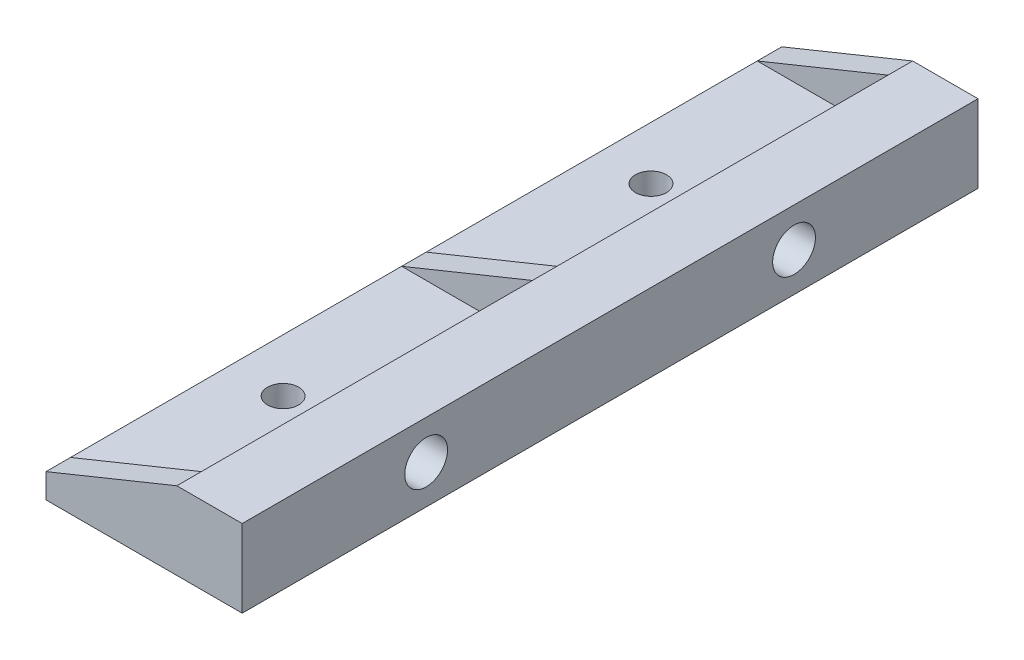
ISO-10303-21;
HEADER;
FILE_DESCRIPTION(('STEP AP214'),'2;1');
FILE_NAME('part.step','',(''),(''),'','','');
FILE_SCHEMA(('AUTOMOTIVE_DESIGN { 1 0 10303 214 1 1 1 1 }'));
ENDSEC;
DATA;
#1=APPLICATION_CONTEXT('core data for automotive mechanical design processes');
#2=APPLICATION_PROTOCOL_DEFINITION('international standard','automotive_design',2000,#1);
#3=PRODUCT_CONTEXT('',#1,'mechanical');
#4=PRODUCT('Part','Part','',(#3));
#5=PRODUCT_RELATED_PRODUCT_CATEGORY('part','',(#4));
#6=PRODUCT_DEFINITION_FORMATION('','',#4);
#7=PRODUCT_DEFINITION_CONTEXT('part definition',#1,'design');
#8=PRODUCT_DEFINITION('design','',#6,#7);
#9=PRODUCT_DEFINITION_SHAPE('','',#8);
#10=(LENGTH_UNIT() NAMED_UNIT(*) SI_UNIT(.MILLI.,.METRE.));
#11=(NAMED_UNIT(*) PLANE_ANGLE_UNIT() SI_UNIT($,.RADIAN.));
#12=(NAMED_UNIT(*) SI_UNIT($,.STERADIAN.) SOLID_ANGLE_UNIT());
#13=UNCERTAINTY_MEASURE_WITH_UNIT(LENGTH_MEASURE(1.E-05),#10,'distance_accuracy_value','');
#14=(GEOMETRIC_REPRESENTATION_CONTEXT(3) GLOBAL_UNCERTAINTY_ASSIGNED_CONTEXT((#13)) GLOBAL_UNIT_ASSIGNED_CONTEXT((#10,
#11,#12)) REPRESENTATION_CONTEXT('',''));
#15=CARTESIAN_POINT('',(0.,0.,0.));
#16=DIRECTION('',(0.,0.,1.));
#17=DIRECTION('',(1.,0.,0.));
#18=AXIS2_PLACEMENT_3D('',#15,#16,#17);
#19=CARTESIAN_POINT('',(-11.,6.,90.));
#20=DIRECTION('',(0.,0.,-1.));
#21=DIRECTION('',(-1.,0.,0.));
#22=AXIS2_PLACEMENT_3D('',#19,#20,#21);
#23=CYLINDRICAL_SURFACE('',#22,3.);
#24=CARTESIAN_POINT('',(-11.,6.,87.));
#25=DIRECTION('',(0.,0.,1.));
#26=DIRECTION('',(1.,0.,0.));
#27=AXIS2_PLACEMENT_3D('',#24,#25,#26);
#28=CIRCLE('',#27,3.);
#29=CARTESIAN_POINT('',(-8.,6.,87.));
#30=VERTEX_POINT('',#29);
#31=CARTESIAN_POINT('',(-11.,3.,87.));
#32=VERTEX_POINT('',#31);
#33=EDGE_CURVE('E233',#30,#32,#28,.F.);
#34=ORIENTED_EDGE('',*,*,#33,.F.);
#35=DIRECTION('',(0.,0.,-1.));
#36=VECTOR('',#35,1.);
#37=CARTESIAN_POINT('',(-8.,6.,90.));
#38=LINE('',#37,#36);
#39=CARTESIAN_POINT('',(-8.,6.,46.5));
#40=VERTEX_POINT('',#39);
#41=EDGE_CURVE('E179',#30,#40,#38,.T.);
#42=ORIENTED_EDGE('',*,*,#41,.T.);
#43=CARTESIAN_POINT('',(-11.,6.,46.5));
#44=DIRECTION('',(0.,0.,-1.));
#45=DIRECTION('',(-1.,0.,0.));
#46=AXIS2_PLACEMENT_3D('',#43,#44,#45);
#47=CIRCLE('',#46,3.);
#48=CARTESIAN_POINT('',(-11.,3.,46.5));
#49=VERTEX_POINT('',#48);
#50=EDGE_CURVE('E210',#49,#40,#47,.F.);
#51=ORIENTED_EDGE('',*,*,#50,.F.);
#52=DIRECTION('',(0.,0.,-1.));
#53=VECTOR('',#52,1.);
#54=CARTESIAN_POINT('',(-11.,3.,90.));
#55=LINE('',#54,#53);
#56=EDGE_CURVE('E282',#32,#49,#55,.T.);
#57=ORIENTED_EDGE('',*,*,#56,.F.);
#58=EDGE_LOOP('',(#34,#42,#51,#57));
#59=FACE_BOUND('',#58,.T.);
#60=ADVANCED_FACE('F40',(#59),#23,.F.);
#61=CARTESIAN_POINT('',(-11.,3.,90.));
#62=DIRECTION('',(0.,-1.,0.));
#63=DIRECTION('',(1.,0.,0.));
#64=AXIS2_PLACEMENT_3D('',#61,#62,#63);
#65=PLANE('',#64);
#66=CARTESIAN_POINT('',(-17.5,3.,67.5));
#67=DIRECTION('',(0.,-1.,0.));
#68=DIRECTION('',(1.,0.,0.));
#69=AXIS2_PLACEMENT_3D('',#66,#67,#68);
#70=CIRCLE('',#69,1.89865);
#71=CARTESIAN_POINT('',(-15.60135,3.,67.5));
#72=VERTEX_POINT('',#71);
#73=EDGE_CURVE('E240',#72,#72,#70,.T.);
#74=ORIENTED_EDGE('',*,*,#73,.T.);
#75=EDGE_LOOP('',(#74));
#76=FACE_BOUND('',#75,.T.);
#77=DIRECTION('',(-1.,0.,0.));
#78=VECTOR('',#77,1.);
#79=CARTESIAN_POINT('',(-11.,3.,87.));
#80=LINE('',#79,#78);
#81=CARTESIAN_POINT('',(-24.,3.,87.));
#82=VERTEX_POINT('',#81);
#83=EDGE_CURVE('E237',#32,#82,#80,.T.);
#84=ORIENTED_EDGE('',*,*,#83,.F.);
#85=ORIENTED_EDGE('',*,*,#56,.T.);
#86=DIRECTION('',(1.,0.,0.));
#87=VECTOR('',#86,1.);
#88=CARTESIAN_POINT('',(-11.,3.,46.5));
#89=LINE('',#88,#87);
#90=CARTESIAN_POINT('',(-24.,3.,46.5));
#91=VERTEX_POINT('',#90);
#92=EDGE_CURVE('E214',#91,#49,#89,.T.);
#93=ORIENTED_EDGE('',*,*,#92,.F.);
#94=DIRECTION('',(0.,0.,-1.));
#95=VECTOR('',#94,1.);
#96=CARTESIAN_POINT('',(-24.,3.,90.));
#97=LINE('',#96,#95);
#98=EDGE_CURVE('E286',#82,#91,#97,.T.);
#99=ORIENTED_EDGE('',*,*,#98,.F.);
#100=EDGE_LOOP('',(#84,#85,#93,#99));
#101=FACE_BOUND('',#100,.T.);
#102=ADVANCED_FACE('F327',(#76,#101),#65,.F.);
#103=CARTESIAN_POINT('',(-8.,9.5,90.));
#104=DIRECTION('',(1.,0.,0.));
#105=DIRECTION('',(0.,0.,-1.));
#106=AXIS2_PLACEMENT_3D('',#103,#104,#105);
#107=PLANE('',#106);
#108=DIRECTION('',(0.,-1.,0.));
#109=VECTOR('',#108,1.);
#110=CARTESIAN_POINT('',(-8.,9.5,87.));
#111=LINE('',#110,#109);
#112=CARTESIAN_POINT('',(-8.,9.5,87.));
#113=VERTEX_POINT('',#112);
#114=EDGE_CURVE('E150',#113,#30,#111,.T.);
#115=ORIENTED_EDGE('',*,*,#114,.F.);
#116=DIRECTION('',(0.,0.,-1.));
#117=VECTOR('',#116,1.);
#118=CARTESIAN_POINT('',(-8.,9.5,90.));
#119=LINE('',#118,#117);
#120=CARTESIAN_POINT('',(-8.,9.5,46.5));
#121=VERTEX_POINT('',#120);
#122=EDGE_CURVE('E165',#113,#121,#119,.T.);
#123=ORIENTED_EDGE('',*,*,#122,.T.);
#124=DIRECTION('',(0.,1.,0.));
#125=VECTOR('',#124,1.);
#126=CARTESIAN_POINT('',(-8.,9.5,46.5));
#127=LINE('',#126,#125);
#128=EDGE_CURVE('E279',#40,#121,#127,.T.);
#129=ORIENTED_EDGE('',*,*,#128,.F.);
#130=ORIENTED_EDGE('',*,*,#41,.F.);
#131=EDGE_LOOP('',(#115,#123,#129,#130));
#132=FACE_BOUND('',#131,.T.);
#133=ADVANCED_FACE('F333',(#132),#107,.F.);
#134=CARTESIAN_POINT('',(-11.,6.,3.));
#135=DIRECTION('',(0.,0.,-1.));
#136=DIRECTION('',(-1.,0.,0.));
#137=AXIS2_PLACEMENT_3D('',#134,#135,#136);
#138=CIRCLE('',#137,3.);
#139=CARTESIAN_POINT('',(-11.,3.,3.00000000000003));
#140=VERTEX_POINT('',#139);
#141=CARTESIAN_POINT('',(-8.,6.,3.00000000000003));
#142=VERTEX_POINT('',#141);
#143=EDGE_CURVE('E57',#140,#142,#138,.F.);
#144=ORIENTED_EDGE('',*,*,#143,.F.);
#145=CARTESIAN_POINT('',(-11.,3.,43.5));
#146=VERTEX_POINT('',#145);
#147=EDGE_CURVE('E284',#146,#140,#55,.T.);
#148=ORIENTED_EDGE('',*,*,#147,.F.);
#149=CARTESIAN_POINT('',(-11.,6.,43.5));
#150=DIRECTION('',(0.,0.,-1.));
#151=DIRECTION('',(-1.,0.,0.));
#152=AXIS2_PLACEMENT_3D('',#149,#150,#151);
#153=CIRCLE('',#152,3.);
#154=CARTESIAN_POINT('',(-8.,6.,43.5));
#155=VERTEX_POINT('',#154);
#156=EDGE_CURVE('E208',#146,#155,#153,.F.);
#157=ORIENTED_EDGE('',*,*,#156,.T.);
#158=EDGE_CURVE('E160',#155,#142,#38,.T.);
#159=ORIENTED_EDGE('',*,*,#158,.T.);
#160=EDGE_LOOP('',(#144,#148,#157,#159));
#161=FACE_BOUND('',#160,.T.);
#162=ADVANCED_FACE('F42',(#161),#23,.F.);
#163=CARTESIAN_POINT('',(-17.5,3.,22.5));
#164=DIRECTION('',(0.,-1.,0.));
#165=DIRECTION('',(1.,0.,0.));
#166=AXIS2_PLACEMENT_3D('',#163,#164,#165);
#167=CIRCLE('',#166,1.89865);
#168=CARTESIAN_POINT('',(-15.60135,3.,22.5));
#169=VERTEX_POINT('',#168);
#170=EDGE_CURVE('E247',#169,#169,#167,.T.);
#171=ORIENTED_EDGE('',*,*,#170,.T.);
#172=EDGE_LOOP('',(#171));
#173=FACE_BOUND('',#172,.T.);
#174=DIRECTION('',(1.,0.,0.));
#175=VECTOR('',#174,1.);
#176=CARTESIAN_POINT('',(-11.,3.,3.));
#177=LINE('',#176,#175);
#178=CARTESIAN_POINT('',(-24.,3.,3.00000000000003));
#179=VERTEX_POINT('',#178);
#180=EDGE_CURVE('E64',#179,#140,#177,.T.);
#181=ORIENTED_EDGE('',*,*,#180,.F.);
#182=CARTESIAN_POINT('',(-24.,3.,43.5));
#183=VERTEX_POINT('',#182);
#184=EDGE_CURVE('E287',#183,#179,#97,.T.);
#185=ORIENTED_EDGE('',*,*,#184,.F.);
#186=DIRECTION('',(1.,0.,0.));
#187=VECTOR('',#186,1.);
#188=CARTESIAN_POINT('',(-11.,3.,43.5));
#189=LINE('',#188,#187);
#190=EDGE_CURVE('E207',#183,#146,#189,.T.);
#191=ORIENTED_EDGE('',*,*,#190,.T.);
#192=ORIENTED_EDGE('',*,*,#147,.T.);
#193=EDGE_LOOP('',(#181,#185,#191,#192));
#194=FACE_BOUND('',#193,.T.);
#195=ADVANCED_FACE('F335',(#173,#194),#65,.F.);
#196=DIRECTION('',(0.,1.,0.));
#197=VECTOR('',#196,1.);
#198=CARTESIAN_POINT('',(-8.,9.5,3.));
#199=LINE('',#198,#197);
#200=CARTESIAN_POINT('',(-8.,9.5,3.00000000000003));
#201=VERTEX_POINT('',#200);
#202=EDGE_CURVE('E12',#142,#201,#199,.T.);
#203=ORIENTED_EDGE('',*,*,#202,.F.);
#204=ORIENTED_EDGE('',*,*,#158,.F.);
#205=DIRECTION('',(0.,1.,0.));
#206=VECTOR('',#205,1.);
#207=CARTESIAN_POINT('',(-8.,9.5,43.5));
#208=LINE('',#207,#206);
#209=CARTESIAN_POINT('',(-8.,9.5,43.5));
#210=VERTEX_POINT('',#209);
#211=EDGE_CURVE('E49',#155,#210,#208,.T.);
#212=ORIENTED_EDGE('',*,*,#211,.T.);
#213=EDGE_CURVE('E171',#210,#201,#119,.T.);
#214=ORIENTED_EDGE('',*,*,#213,.T.);
#215=EDGE_LOOP('',(#203,#204,#212,#214));
#216=FACE_BOUND('',#215,.T.);
#217=ADVANCED_FACE('F311',(#216),#107,.F.);
#218=CARTESIAN_POINT('',(-24.,3.,90.));
#219=DIRECTION('',(1.,0.,0.));
#220=DIRECTION('',(0.,0.,-1.));
#221=AXIS2_PLACEMENT_3D('',#218,#219,#220);
#222=PLANE('',#221);
#223=CARTESIAN_POINT('',(-24.,3.,90.));
#224=VERTEX_POINT('',#223);
#225=EDGE_CURVE('E147',#224,#82,#97,.T.);
#226=ORIENTED_EDGE('',*,*,#225,.T.);
#227=ORIENTED_EDGE('',*,*,#98,.T.);
#228=DIRECTION('',(0.,0.,-1.));
#229=VECTOR('',#228,1.);
#230=CARTESIAN_POINT('',(-24.,3.,90.));
#231=LINE('',#230,#229);
#232=EDGE_CURVE('E199',#183,#91,#231,.F.);
#233=ORIENTED_EDGE('',*,*,#232,.F.);
#234=ORIENTED_EDGE('',*,*,#184,.T.);
#235=DIRECTION('',(0.,0.,-1.));
#236=VECTOR('',#235,1.);
#237=CARTESIAN_POINT('',(-24.,3.,90.));
#238=LINE('',#237,#236);
#239=CARTESIAN_POINT('',(-24.,3.,0.));
#240=VERTEX_POINT('',#239);
#241=EDGE_CURVE('E224',#240,#179,#238,.F.);
#242=ORIENTED_EDGE('',*,*,#241,.F.);
#243=DIRECTION('',(0.,-1.,0.));
#244=VECTOR('',#243,1.);
#245=CARTESIAN_POINT('',(-24.,3.,0.));
#246=LINE('',#245,#244);
#247=CARTESIAN_POINT('',(-24.,0.,0.));
#248=VERTEX_POINT('',#247);
#249=EDGE_CURVE('E197',#240,#248,#246,.T.);
#250=ORIENTED_EDGE('',*,*,#249,.T.);
#251=DIRECTION('',(0.,0.,-1.));
#252=VECTOR('',#251,1.);
#253=CARTESIAN_POINT('',(-24.,0.,90.));
#254=LINE('',#253,#252);
#255=CARTESIAN_POINT('',(-24.,0.,90.));
#256=VERTEX_POINT('',#255);
#257=EDGE_CURVE('E288',#256,#248,#254,.T.);
#258=ORIENTED_EDGE('',*,*,#257,.F.);
#259=DIRECTION('',(0.,-1.,0.));
#260=VECTOR('',#259,1.);
#261=CARTESIAN_POINT('',(-24.,3.,90.));
#262=LINE('',#261,#260);
#263=EDGE_CURVE('E190',#224,#256,#262,.T.);
#264=ORIENTED_EDGE('',*,*,#263,.F.);
#265=EDGE_LOOP('',(#226,#227,#233,#234,#242,#250,#258,#264));
#266=FACE_BOUND('',#265,.T.);
#267=ADVANCED_FACE('F322',(#266),#222,.F.);
#268=CARTESIAN_POINT('',(-24.,0.,90.));
#269=DIRECTION('',(0.,1.,0.));
#270=DIRECTION('',(0.,0.,1.));
#271=AXIS2_PLACEMENT_3D('',#268,#269,#270);
#272=PLANE('',#271);
#273=CARTESIAN_POINT('',(-17.5,0.,22.5));
#274=DIRECTION('',(0.,-1.,0.));
#275=DIRECTION('',(0.,0.,-1.));
#276=AXIS2_PLACEMENT_3D('',#273,#274,#275);
#277=CIRCLE('',#276,1.89865);
#278=CARTESIAN_POINT('',(-17.5,0.,20.60135));
#279=VERTEX_POINT('',#278);
#280=EDGE_CURVE('E250',#279,#279,#277,.T.);
#281=ORIENTED_EDGE('',*,*,#280,.F.);
#282=EDGE_LOOP('',(#281));
#283=FACE_BOUND('',#282,.T.);
#284=CARTESIAN_POINT('',(-17.5,0.,67.5));
#285=DIRECTION('',(0.,-1.,0.));
#286=DIRECTION('',(0.,0.,-1.));
#287=AXIS2_PLACEMENT_3D('',#284,#285,#286);
#288=CIRCLE('',#287,1.89865);
#289=CARTESIAN_POINT('',(-17.5,0.,65.60135));
#290=VERTEX_POINT('',#289);
#291=EDGE_CURVE('E244',#290,#290,#288,.T.);
#292=ORIENTED_EDGE('',*,*,#291,.F.);
#293=EDGE_LOOP('',(#292));
#294=FACE_BOUND('',#293,.T.);
#295=ORIENTED_EDGE('',*,*,#257,.T.);
#296=DIRECTION('',(1.,0.,0.));
#297=VECTOR('',#296,1.);
#298=CARTESIAN_POINT('',(-24.,0.,0.));
#299=LINE('',#298,#297);
#300=CARTESIAN_POINT('',(0.,0.,0.));
#301=VERTEX_POINT('',#300);
#302=EDGE_CURVE('E194',#248,#301,#299,.T.);
#303=ORIENTED_EDGE('',*,*,#302,.T.);
#304=DIRECTION('',(0.,0.,-1.));
#305=VECTOR('',#304,1.);
#306=CARTESIAN_POINT('',(0.,0.,90.));
#307=LINE('',#306,#305);
#308=CARTESIAN_POINT('',(0.,0.,90.));
#309=VERTEX_POINT('',#308);
#310=EDGE_CURVE('E169',#309,#301,#307,.T.);
#311=ORIENTED_EDGE('',*,*,#310,.F.);
#312=DIRECTION('',(1.,0.,0.));
#313=VECTOR('',#312,1.);
#314=CARTESIAN_POINT('',(-24.,0.,90.));
#315=LINE('',#314,#313);
#316=EDGE_CURVE('E202',#256,#309,#315,.T.);
#317=ORIENTED_EDGE('',*,*,#316,.F.);
#318=EDGE_LOOP('',(#295,#303,#311,#317));
#319=FACE_BOUND('',#318,.T.);
#320=ADVANCED_FACE('F298',(#283,#294,#319),#272,.F.);
#321=CARTESIAN_POINT('',(0.,0.,90.));
#322=DIRECTION('',(-1.,0.,0.));
#323=DIRECTION('',(0.,0.,1.));
#324=AXIS2_PLACEMENT_3D('',#321,#322,#323);
#325=PLANE('',#324);
#326=CARTESIAN_POINT('',(0.,4.75,67.5));
#327=DIRECTION('',(1.,0.,0.));
#328=DIRECTION('',(0.,0.,-1.));
#329=AXIS2_PLACEMENT_3D('',#326,#327,#328);
#330=CIRCLE('',#329,2.6162);
#331=CARTESIAN_POINT('',(0.,4.75,64.8838));
#332=VERTEX_POINT('',#331);
#333=EDGE_CURVE('E265',#332,#332,#330,.T.);
#334=ORIENTED_EDGE('',*,*,#333,.F.);
#335=EDGE_LOOP('',(#334));
#336=FACE_BOUND('',#335,.T.);
#337=CARTESIAN_POINT('',(0.,4.75,22.5));
#338=DIRECTION('',(1.,0.,0.));
#339=DIRECTION('',(0.,0.,-1.));
#340=AXIS2_PLACEMENT_3D('',#337,#338,#339);
#341=CIRCLE('',#340,2.6162);
#342=CARTESIAN_POINT('',(0.,4.75,19.8838));
#343=VERTEX_POINT('',#342);
#344=EDGE_CURVE('E259',#343,#343,#341,.T.);
#345=ORIENTED_EDGE('',*,*,#344,.F.);
#346=EDGE_LOOP('',(#345));
#347=FACE_BOUND('',#346,.T.);
#348=ORIENTED_EDGE('',*,*,#310,.T.);
#349=DIRECTION('',(0.,1.,0.));
#350=VECTOR('',#349,1.);
#351=CARTESIAN_POINT('',(0.,0.,0.));
#352=LINE('',#351,#350);
#353=CARTESIAN_POINT('',(0.,9.5,0.));
#354=VERTEX_POINT('',#353);
#355=EDGE_CURVE('E191',#301,#354,#352,.T.);
#356=ORIENTED_EDGE('',*,*,#355,.T.);
#357=DIRECTION('',(0.,0.,-1.));
#358=VECTOR('',#357,1.);
#359=CARTESIAN_POINT('',(0.,9.5,90.));
#360=LINE('',#359,#358);
#361=CARTESIAN_POINT('',(0.,9.5,90.));
#362=VERTEX_POINT('',#361);
#363=EDGE_CURVE('E166',#362,#354,#360,.T.);
#364=ORIENTED_EDGE('',*,*,#363,.F.);
#365=DIRECTION('',(0.,1.,0.));
#366=VECTOR('',#365,1.);
#367=CARTESIAN_POINT('',(0.,0.,90.));
#368=LINE('',#367,#366);
#369=EDGE_CURVE('E157',#309,#362,#368,.T.);
#370=ORIENTED_EDGE('',*,*,#369,.F.);
#371=EDGE_LOOP('',(#348,#356,#364,#370));
#372=FACE_BOUND('',#371,.T.);
#373=ADVANCED_FACE('F292',(#336,#347,#372),#325,.F.);
#374=CARTESIAN_POINT('',(0.,9.5,90.));
#375=DIRECTION('',(0.,-1.,0.));
#376=DIRECTION('',(0.,0.,-1.));
#377=AXIS2_PLACEMENT_3D('',#374,#375,#376);
#378=PLANE('',#377);
#379=ORIENTED_EDGE('',*,*,#363,.T.);
#380=DIRECTION('',(-1.,0.,0.));
#381=VECTOR('',#380,1.);
#382=CARTESIAN_POINT('',(0.,9.5,0.));
#383=LINE('',#382,#381);
#384=CARTESIAN_POINT('',(-8.,9.5,0.));
#385=VERTEX_POINT('',#384);
#386=EDGE_CURVE('E188',#354,#385,#383,.T.);
#387=ORIENTED_EDGE('',*,*,#386,.T.);
#388=DIRECTION('',(0.,0.,-1.));
#389=VECTOR('',#388,1.);
#390=CARTESIAN_POINT('',(-8.,9.5,90.));
#391=LINE('',#390,#389);
#392=EDGE_CURVE('E227',#385,#201,#391,.F.);
#393=ORIENTED_EDGE('',*,*,#392,.T.);
#394=ORIENTED_EDGE('',*,*,#213,.F.);
#395=EDGE_CURVE('E168',#121,#210,#119,.T.);
#396=ORIENTED_EDGE('',*,*,#395,.F.);
#397=ORIENTED_EDGE('',*,*,#122,.F.);
#398=CARTESIAN_POINT('',(-8.,9.5,90.));
#399=VERTEX_POINT('',#398);
#400=EDGE_CURVE('E144',#399,#113,#119,.T.);
#401=ORIENTED_EDGE('',*,*,#400,.F.);
#402=DIRECTION('',(-1.,0.,0.));
#403=VECTOR('',#402,1.);
#404=CARTESIAN_POINT('',(0.,9.5,90.));
#405=LINE('',#404,#403);
#406=EDGE_CURVE('E154',#362,#399,#405,.T.);
#407=ORIENTED_EDGE('',*,*,#406,.F.);
#408=EDGE_LOOP('',(#379,#387,#393,#394,#396,#397,#401,#407));
#409=FACE_BOUND('',#408,.T.);
#410=ADVANCED_FACE('F163',(#409),#378,.F.);
#411=CARTESIAN_POINT('',(-11.,6.,90.));
#412=DIRECTION('',(0.,0.,-1.));
#413=DIRECTION('',(-1.,0.,0.));
#414=AXIS2_PLACEMENT_3D('',#411,#412,#413);
#415=PLANE('',#414);
#416=DIRECTION('',(-0.926466577122309,-0.376377046955938,0.));
#417=VECTOR('',#416,1.);
#418=CARTESIAN_POINT('',(-8.,9.5,90.));
#419=LINE('',#418,#417);
#420=EDGE_CURVE('E139',#399,#224,#419,.T.);
#421=ORIENTED_EDGE('',*,*,#420,.T.);
#422=ORIENTED_EDGE('',*,*,#263,.T.);
#423=ORIENTED_EDGE('',*,*,#316,.T.);
#424=ORIENTED_EDGE('',*,*,#369,.T.);
#425=ORIENTED_EDGE('',*,*,#406,.T.);
#426=EDGE_LOOP('',(#421,#422,#423,#424,#425));
#427=FACE_BOUND('',#426,.T.);
#428=ADVANCED_FACE('F155',(#427),#415,.F.);
#429=CARTESIAN_POINT('',(-11.,6.,0.));
#430=DIRECTION('',(0.,0.,-1.));
#431=DIRECTION('',(-1.,0.,0.));
#432=AXIS2_PLACEMENT_3D('',#429,#430,#431);
#433=PLANE('',#432);
#434=DIRECTION('',(-0.926466577122309,-0.376377046955938,0.));
#435=VECTOR('',#434,1.);
#436=CARTESIAN_POINT('',(-8.,9.5,0.));
#437=LINE('',#436,#435);
#438=EDGE_CURVE('E229',#385,#240,#437,.T.);
#439=ORIENTED_EDGE('',*,*,#438,.F.);
#440=ORIENTED_EDGE('',*,*,#386,.F.);
#441=ORIENTED_EDGE('',*,*,#355,.F.);
#442=ORIENTED_EDGE('',*,*,#302,.F.);
#443=ORIENTED_EDGE('',*,*,#249,.F.);
#444=EDGE_LOOP('',(#439,#440,#441,#442,#443));
#445=FACE_BOUND('',#444,.T.);
#446=ADVANCED_FACE('F302',(#445),#433,.T.);
#447=CARTESIAN_POINT('',(-8.,9.5,45.));
#448=DIRECTION('',(0.376377046955938,-0.926466577122309,0.));
#449=DIRECTION('',(-0.926466577122309,-0.376377046955938,0.));
#450=AXIS2_PLACEMENT_3D('',#447,#448,#449);
#451=PLANE('',#450);
#452=DIRECTION('',(-0.926466577122309,-0.376377046955938,0.));
#453=VECTOR('',#452,1.);
#454=CARTESIAN_POINT('',(-8.,9.5,43.5));
#455=LINE('',#454,#453);
#456=EDGE_CURVE('E217',#210,#183,#455,.T.);
#457=ORIENTED_EDGE('',*,*,#456,.T.);
#458=ORIENTED_EDGE('',*,*,#232,.T.);
#459=DIRECTION('',(-0.926466577122309,-0.376377046955938,0.));
#460=VECTOR('',#459,1.);
#461=CARTESIAN_POINT('',(-8.,9.5,46.5));
#462=LINE('',#461,#460);
#463=EDGE_CURVE('E218',#121,#91,#462,.T.);
#464=ORIENTED_EDGE('',*,*,#463,.F.);
#465=ORIENTED_EDGE('',*,*,#395,.T.);
#466=EDGE_LOOP('',(#457,#458,#464,#465));
#467=FACE_BOUND('',#466,.T.);
#468=ADVANCED_FACE('F319',(#467),#451,.F.);
#469=CARTESIAN_POINT('',(-12.,4.75,43.5));
#470=DIRECTION('',(0.,0.,-1.));
#471=DIRECTION('',(-1.,0.,0.));
#472=AXIS2_PLACEMENT_3D('',#469,#470,#471);
#473=PLANE('',#472);
#474=ORIENTED_EDGE('',*,*,#190,.F.);
#475=ORIENTED_EDGE('',*,*,#456,.F.);
#476=ORIENTED_EDGE('',*,*,#211,.F.);
#477=ORIENTED_EDGE('',*,*,#156,.F.);
#478=EDGE_LOOP('',(#474,#475,#476,#477));
#479=FACE_BOUND('',#478,.T.);
#480=ADVANCED_FACE('F315',(#479),#473,.T.);
#481=CARTESIAN_POINT('',(-12.,4.75,46.5));
#482=DIRECTION('',(0.,0.,-1.));
#483=DIRECTION('',(-1.,0.,0.));
#484=AXIS2_PLACEMENT_3D('',#481,#482,#483);
#485=PLANE('',#484);
#486=ORIENTED_EDGE('',*,*,#92,.T.);
#487=ORIENTED_EDGE('',*,*,#50,.T.);
#488=ORIENTED_EDGE('',*,*,#128,.T.);
#489=ORIENTED_EDGE('',*,*,#463,.T.);
#490=EDGE_LOOP('',(#486,#487,#488,#489));
#491=FACE_BOUND('',#490,.T.);
#492=ADVANCED_FACE('F317',(#491),#485,.F.);
#493=CARTESIAN_POINT('',(-12.,4.75,3.));
#494=DIRECTION('',(0.,0.,-1.));
#495=DIRECTION('',(-1.,0.,0.));
#496=AXIS2_PLACEMENT_3D('',#493,#494,#495);
#497=PLANE('',#496);
#498=ORIENTED_EDGE('',*,*,#180,.T.);
#499=ORIENTED_EDGE('',*,*,#143,.T.);
#500=ORIENTED_EDGE('',*,*,#202,.T.);
#501=DIRECTION('',(-0.926466577122309,-0.376377046955938,0.));
#502=VECTOR('',#501,1.);
#503=CARTESIAN_POINT('',(-8.,9.5,3.));
#504=LINE('',#503,#502);
#505=EDGE_CURVE('E230',#201,#179,#504,.T.);
#506=ORIENTED_EDGE('',*,*,#505,.T.);
#507=EDGE_LOOP('',(#498,#499,#500,#506));
#508=FACE_BOUND('',#507,.T.);
#509=ADVANCED_FACE('F309',(#508),#497,.F.);
#510=CARTESIAN_POINT('',(-8.,9.5,0.));
#511=DIRECTION('',(0.376377046955938,-0.926466577122309,0.));
#512=DIRECTION('',(-0.926466577122309,-0.376377046955938,0.));
#513=AXIS2_PLACEMENT_3D('',#510,#511,#512);
#514=PLANE('',#513);
#515=ORIENTED_EDGE('',*,*,#438,.T.);
#516=ORIENTED_EDGE('',*,*,#241,.T.);
#517=ORIENTED_EDGE('',*,*,#505,.F.);
#518=ORIENTED_EDGE('',*,*,#392,.F.);
#519=EDGE_LOOP('',(#515,#516,#517,#518));
#520=FACE_BOUND('',#519,.T.);
#521=ADVANCED_FACE('F306',(#520),#514,.F.);
#522=CARTESIAN_POINT('',(-12.,4.75,87.));
#523=DIRECTION('',(0.,0.,1.));
#524=DIRECTION('',(1.,0.,0.));
#525=AXIS2_PLACEMENT_3D('',#522,#523,#524);
#526=PLANE('',#525);
#527=ORIENTED_EDGE('',*,*,#114,.T.);
#528=ORIENTED_EDGE('',*,*,#33,.T.);
#529=ORIENTED_EDGE('',*,*,#83,.T.);
#530=DIRECTION('',(-0.926466577122309,-0.376377046955938,0.));
#531=VECTOR('',#530,1.);
#532=CARTESIAN_POINT('',(-8.,9.5,87.));
#533=LINE('',#532,#531);
#534=EDGE_CURVE('E151',#113,#82,#533,.T.);
#535=ORIENTED_EDGE('',*,*,#534,.F.);
#536=EDGE_LOOP('',(#527,#528,#529,#535));
#537=FACE_BOUND('',#536,.T.);
#538=ADVANCED_FACE('F378',(#537),#526,.F.);
#539=CARTESIAN_POINT('',(-8.,9.5,90.));
#540=DIRECTION('',(-0.376377046955938,0.926466577122309,0.));
#541=DIRECTION('',(-0.926466577122309,-0.376377046955938,0.));
#542=AXIS2_PLACEMENT_3D('',#539,#540,#541);
#543=PLANE('',#542);
#544=ORIENTED_EDGE('',*,*,#534,.T.);
#545=ORIENTED_EDGE('',*,*,#225,.F.);
#546=ORIENTED_EDGE('',*,*,#420,.F.);
#547=ORIENTED_EDGE('',*,*,#400,.T.);
#548=EDGE_LOOP('',(#544,#545,#546,#547));
#549=FACE_BOUND('',#548,.T.);
#550=ADVANCED_FACE('F142',(#549),#543,.T.);
#551=CARTESIAN_POINT('',(-17.5,0.,67.5));
#552=DIRECTION('',(0.,-1.,0.));
#553=DIRECTION('',(0.,0.,-1.));
#554=AXIS2_PLACEMENT_3D('',#551,#552,#553);
#555=CYLINDRICAL_SURFACE('',#554,1.89865);
#556=ORIENTED_EDGE('',*,*,#291,.T.);
#557=EDGE_LOOP('',(#556));
#558=FACE_BOUND('',#557,.T.);
#559=ORIENTED_EDGE('',*,*,#73,.F.);
#560=EDGE_LOOP('',(#559));
#561=FACE_BOUND('',#560,.T.);
#562=ADVANCED_FACE('F383',(#558,#561),#555,.F.);
#563=CARTESIAN_POINT('',(-17.5,0.,22.5));
#564=DIRECTION('',(0.,-1.,0.));
#565=DIRECTION('',(0.,0.,-1.));
#566=AXIS2_PLACEMENT_3D('',#563,#564,#565);
#567=CYLINDRICAL_SURFACE('',#566,1.89865);
#568=ORIENTED_EDGE('',*,*,#280,.T.);
#569=EDGE_LOOP('',(#568));
#570=FACE_BOUND('',#569,.T.);
#571=ORIENTED_EDGE('',*,*,#170,.F.);
#572=EDGE_LOOP('',(#571));
#573=FACE_BOUND('',#572,.T.);
#574=ADVANCED_FACE('F389',(#570,#573),#567,.F.);
#575=CARTESIAN_POINT('',(-6.35,4.75,67.5));
#576=DIRECTION('',(1.,0.,0.));
#577=DIRECTION('',(0.,0.,-1.));
#578=AXIS2_PLACEMENT_3D('',#575,#576,#577);
#579=PLANE('',#578);
#580=CARTESIAN_POINT('',(-6.35,4.75,67.5));
#581=DIRECTION('',(1.,0.,0.));
#582=DIRECTION('',(0.,0.,-1.));
#583=AXIS2_PLACEMENT_3D('',#580,#581,#582);
#584=CIRCLE('',#583,2.6162);
#585=CARTESIAN_POINT('',(-6.35,4.75,64.8838));
#586=VERTEX_POINT('',#585);
#587=EDGE_CURVE('E268',#586,#586,#584,.T.);
#588=ORIENTED_EDGE('',*,*,#587,.T.);
#589=EDGE_LOOP('',(#588));
#590=FACE_BOUND('',#589,.T.);
#591=CARTESIAN_POINT('',(-6.35,4.75,67.5));
#592=DIRECTION('',(1.,0.,0.));
#593=DIRECTION('',(0.,0.,-1.));
#594=AXIS2_PLACEMENT_3D('',#591,#592,#593);
#595=CIRCLE('',#594,2.3495);
#596=CARTESIAN_POINT('',(-6.35,4.75,65.1505));
#597=VERTEX_POINT('',#596);
#598=EDGE_CURVE('E270',#597,#597,#595,.F.);
#599=ORIENTED_EDGE('',*,*,#598,.T.);
#600=EDGE_LOOP('',(#599));
#601=FACE_BOUND('',#600,.T.);
#602=ADVANCED_FACE('F393',(#590,#601),#579,.T.);
#603=CARTESIAN_POINT('',(-6.35,4.75,67.5));
#604=DIRECTION('',(1.,0.,0.));
#605=DIRECTION('',(0.,0.,-1.));
#606=AXIS2_PLACEMENT_3D('',#603,#604,#605);
#607=CYLINDRICAL_SURFACE('',#606,2.6162);
#608=ORIENTED_EDGE('',*,*,#587,.F.);
#609=EDGE_LOOP('',(#608));
#610=FACE_BOUND('',#609,.T.);
#611=ORIENTED_EDGE('',*,*,#333,.T.);
#612=EDGE_LOOP('',(#611));
#613=FACE_BOUND('',#612,.T.);
#614=ADVANCED_FACE('F418',(#610,#613),#607,.F.);
#615=CARTESIAN_POINT('',(-6.35,4.75,22.5));
#616=DIRECTION('',(1.,0.,0.));
#617=DIRECTION('',(0.,0.,-1.));
#618=AXIS2_PLACEMENT_3D('',#615,#616,#617);
#619=PLANE('',#618);
#620=CARTESIAN_POINT('',(-6.35,4.75,22.5));
#621=DIRECTION('',(1.,0.,0.));
#622=DIRECTION('',(0.,0.,-1.));
#623=AXIS2_PLACEMENT_3D('',#620,#621,#622);
#624=CIRCLE('',#623,2.6162);
#625=CARTESIAN_POINT('',(-6.35,4.75,19.8838));
#626=VERTEX_POINT('',#625);
#627=EDGE_CURVE('E262',#626,#626,#624,.T.);
#628=ORIENTED_EDGE('',*,*,#627,.T.);
#629=EDGE_LOOP('',(#628));
#630=FACE_BOUND('',#629,.T.);
#631=CARTESIAN_POINT('',(-6.35,4.75,22.5));
#632=DIRECTION('',(1.,0.,0.));
#633=DIRECTION('',(0.,0.,-1.));
#634=AXIS2_PLACEMENT_3D('',#631,#632,#633);
#635=CIRCLE('',#634,2.3495);
#636=CARTESIAN_POINT('',(-6.35,4.75,20.1505));
#637=VERTEX_POINT('',#636);
#638=EDGE_CURVE('E44',#637,#637,#635,.F.);
#639=ORIENTED_EDGE('',*,*,#638,.T.);
#640=EDGE_LOOP('',(#639));
#641=FACE_BOUND('',#640,.T.);
#642=ADVANCED_FACE('F414',(#630,#641),#619,.T.);
#643=CARTESIAN_POINT('',(-6.35,4.75,22.5));
#644=DIRECTION('',(1.,0.,0.));
#645=DIRECTION('',(0.,0.,-1.));
#646=AXIS2_PLACEMENT_3D('',#643,#644,#645);
#647=CYLINDRICAL_SURFACE('',#646,2.6162);
#648=ORIENTED_EDGE('',*,*,#627,.F.);
#649=EDGE_LOOP('',(#648));
#650=FACE_BOUND('',#649,.T.);
#651=ORIENTED_EDGE('',*,*,#344,.T.);
#652=EDGE_LOOP('',(#651));
#653=FACE_BOUND('',#652,.T.);
#654=ADVANCED_FACE('F410',(#650,#653),#647,.F.);
#655=CARTESIAN_POINT('',(-7.,9.5,90.));
#656=DIRECTION('',(1.,0.,0.));
#657=DIRECTION('',(0.,0.,-1.));
#658=AXIS2_PLACEMENT_3D('',#655,#656,#657);
#659=PLANE('',#658);
#660=CARTESIAN_POINT('',(-7.,4.75,67.5));
#661=DIRECTION('',(1.,0.,0.));
#662=DIRECTION('',(0.,0.,-1.));
#663=AXIS2_PLACEMENT_3D('',#660,#661,#662);
#664=CIRCLE('',#663,2.3495);
#665=CARTESIAN_POINT('',(-7.,4.75,65.1505));
#666=VERTEX_POINT('',#665);
#667=EDGE_CURVE('E253',#666,#666,#664,.F.);
#668=ORIENTED_EDGE('',*,*,#667,.F.);
#669=EDGE_LOOP('',(#668));
#670=FACE_BOUND('',#669,.T.);
#671=ADVANCED_FACE('F406',(#670),#659,.T.);
#672=CARTESIAN_POINT('',(-14.6453895295912,4.75,67.5));
#673=DIRECTION('',(1.,0.,0.));
#674=DIRECTION('',(0.,0.,-1.));
#675=AXIS2_PLACEMENT_3D('',#672,#673,#674);
#676=CYLINDRICAL_SURFACE('',#675,2.3495);
#677=ORIENTED_EDGE('',*,*,#667,.T.);
#678=EDGE_LOOP('',(#677));
#679=FACE_BOUND('',#678,.T.);
#680=ORIENTED_EDGE('',*,*,#598,.F.);
#681=EDGE_LOOP('',(#680));
#682=FACE_BOUND('',#681,.T.);
#683=ADVANCED_FACE('F402',(#679,#682),#676,.F.);
#684=CARTESIAN_POINT('',(-7.,9.5,90.));
#685=DIRECTION('',(1.,0.,0.));
#686=DIRECTION('',(0.,0.,-1.));
#687=AXIS2_PLACEMENT_3D('',#684,#685,#686);
#688=PLANE('',#687);
#689=CARTESIAN_POINT('',(-7.,4.75,22.5));
#690=DIRECTION('',(1.,0.,0.));
#691=DIRECTION('',(0.,0.,-1.));
#692=AXIS2_PLACEMENT_3D('',#689,#690,#691);
#693=CIRCLE('',#692,2.3495);
#694=CARTESIAN_POINT('',(-7.,4.75,20.1505));
#695=VERTEX_POINT('',#694);
#696=EDGE_CURVE('E254',#695,#695,#693,.F.);
#697=ORIENTED_EDGE('',*,*,#696,.F.);
#698=EDGE_LOOP('',(#697));
#699=FACE_BOUND('',#698,.T.);
#700=ADVANCED_FACE('F398',(#699),#688,.T.);
#701=CARTESIAN_POINT('',(-14.6453895295912,4.75,22.5));
#702=DIRECTION('',(1.,0.,0.));
#703=DIRECTION('',(0.,0.,-1.));
#704=AXIS2_PLACEMENT_3D('',#701,#702,#703);
#705=CYLINDRICAL_SURFACE('',#704,2.3495);
#706=ORIENTED_EDGE('',*,*,#696,.T.);
#707=EDGE_LOOP('',(#706));
#708=FACE_BOUND('',#707,.T.);
#709=ORIENTED_EDGE('',*,*,#638,.F.);
#710=EDGE_LOOP('',(#709));
#711=FACE_BOUND('',#710,.T.);
#712=ADVANCED_FACE('F395',(#708,#711),#705,.F.);
#713=CLOSED_SHELL('',(#60,#102,#133,#162,#195,#217,#267,#320,#373,#410,#428,#446,#468,#480,#492,
#509,#521,#538,#550,#562,#574,#602,#614,#642,#654,#671,#683,#700,#712));
#714=MANIFOLD_SOLID_BREP('B2',#713);
#715=ADVANCED_BREP_SHAPE_REPRESENTATION('',(#18,#714),#14);
#716=SHAPE_DEFINITION_REPRESENTATION(#9,#715);
ENDSEC;
END-ISO-10303-21;
